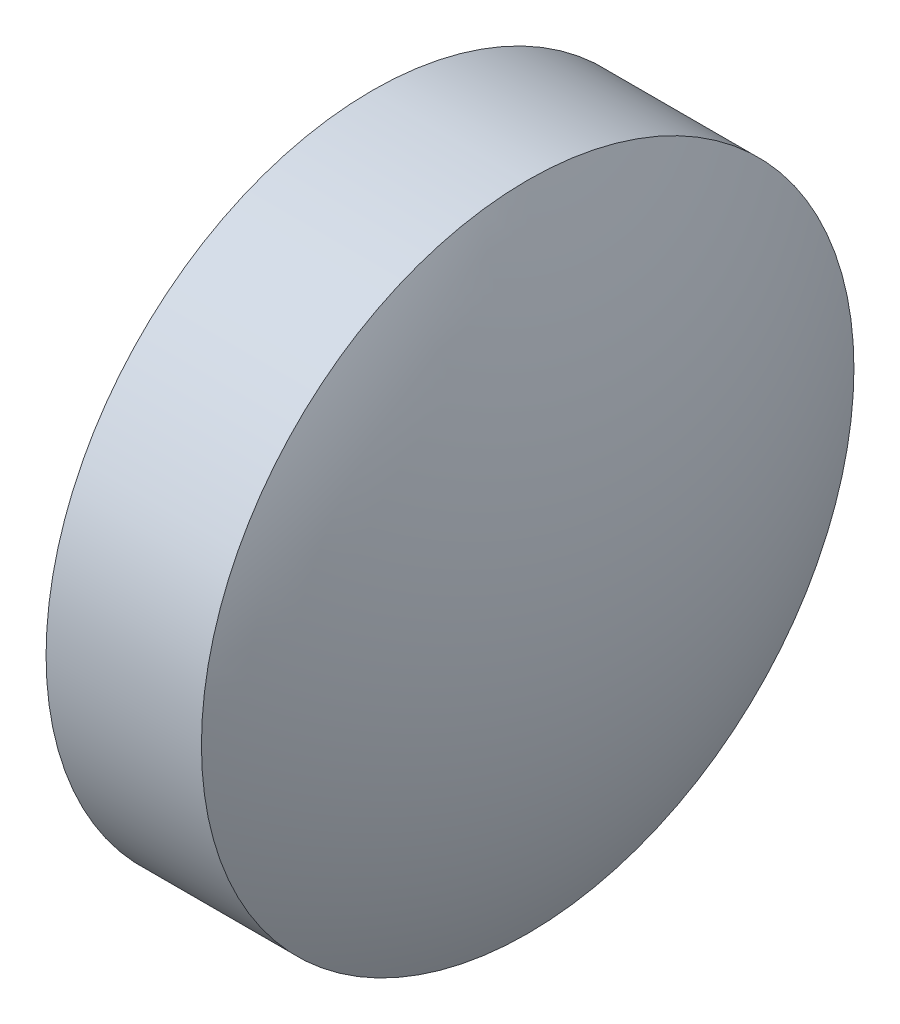
ISO-10303-21;
HEADER;
FILE_DESCRIPTION(('STEP AP214'),'2;1');
FILE_NAME('part.step','',(''),(''),'','','');
FILE_SCHEMA(('AUTOMOTIVE_DESIGN { 1 0 10303 214 1 1 1 1 }'));
ENDSEC;
DATA;
#1=APPLICATION_CONTEXT('core data for automotive mechanical design processes');
#2=APPLICATION_PROTOCOL_DEFINITION('international standard','automotive_design',2000,#1);
#3=PRODUCT_CONTEXT('',#1,'mechanical');
#4=PRODUCT('Part','Part','',(#3));
#5=PRODUCT_RELATED_PRODUCT_CATEGORY('part','',(#4));
#6=PRODUCT_DEFINITION_FORMATION('','',#4);
#7=PRODUCT_DEFINITION_CONTEXT('part definition',#1,'design');
#8=PRODUCT_DEFINITION('design','',#6,#7);
#9=PRODUCT_DEFINITION_SHAPE('','',#8);
#10=(LENGTH_UNIT() NAMED_UNIT(*) SI_UNIT(.MILLI.,.METRE.));
#11=(NAMED_UNIT(*) PLANE_ANGLE_UNIT() SI_UNIT($,.RADIAN.));
#12=(NAMED_UNIT(*) SI_UNIT($,.STERADIAN.) SOLID_ANGLE_UNIT());
#13=UNCERTAINTY_MEASURE_WITH_UNIT(LENGTH_MEASURE(1.E-05),#10,'distance_accuracy_value','');
#14=(GEOMETRIC_REPRESENTATION_CONTEXT(3) GLOBAL_UNCERTAINTY_ASSIGNED_CONTEXT((#13)) GLOBAL_UNIT_ASSIGNED_CONTEXT((#10,
#11,#12)) REPRESENTATION_CONTEXT('',''));
#15=CARTESIAN_POINT('',(0.,0.,0.));
#16=DIRECTION('',(0.,0.,1.));
#17=DIRECTION('',(1.,0.,0.));
#18=AXIS2_PLACEMENT_3D('',#15,#16,#17);
#19=CARTESIAN_POINT('',(396.540495166032,12.4456585558419,0.));
#20=DIRECTION('',(-1.,0.,0.));
#21=DIRECTION('',(0.,-1.,0.));
#22=AXIS2_PLACEMENT_3D('',#19,#20,#21);
#23=SPHERICAL_SURFACE('',#22,6.90796052631582);
#24=CARTESIAN_POINT('',(402.688455692348,12.4456585558419,0.));
#25=DIRECTION('',(-1.,0.,0.));
#26=DIRECTION('',(0.,0.,1.));
#27=AXIS2_PLACEMENT_3D('',#24,#25,#26);
#28=CIRCLE('',#27,3.15);
#29=CARTESIAN_POINT('',(402.688455692348,12.4456585558419,3.15));
#30=VERTEX_POINT('',#29);
#31=EDGE_CURVE('E10',#30,#30,#28,.T.);
#32=ORIENTED_EDGE('',*,*,#31,.F.);
#33=EDGE_LOOP('',(#32));
#34=FACE_BOUND('',#33,.T.);
#35=ADVANCED_FACE('F35',(#34),#23,.T.);
#36=CARTESIAN_POINT('',(400.327817603599,12.4456585558419,0.));
#37=DIRECTION('',(-1.,0.,0.));
#38=DIRECTION('',(0.,0.,1.));
#39=AXIS2_PLACEMENT_3D('',#36,#37,#38);
#40=CYLINDRICAL_SURFACE('',#39,3.15);
#41=CARTESIAN_POINT('',(401.188455692348,12.4456585558419,0.));
#42=DIRECTION('',(-1.,0.,0.));
#43=DIRECTION('',(0.,0.,1.));
#44=AXIS2_PLACEMENT_3D('',#41,#42,#43);
#45=CIRCLE('',#44,3.15);
#46=CARTESIAN_POINT('',(401.188455692348,12.4456585558419,3.15));
#47=VERTEX_POINT('',#46);
#48=EDGE_CURVE('E41',#47,#47,#45,.T.);
#49=ORIENTED_EDGE('',*,*,#48,.F.);
#50=EDGE_LOOP('',(#49));
#51=FACE_BOUND('',#50,.T.);
#52=ORIENTED_EDGE('',*,*,#31,.T.);
#53=EDGE_LOOP('',(#52));
#54=FACE_BOUND('',#53,.T.);
#55=ADVANCED_FACE('F49',(#51,#54),#40,.T.);
#56=CARTESIAN_POINT('',(401.188455692348,12.4456585558419,0.));
#57=DIRECTION('',(1.,0.,0.));
#58=DIRECTION('',(0.,0.,-1.));
#59=AXIS2_PLACEMENT_3D('',#56,#57,#58);
#60=PLANE('',#59);
#61=ORIENTED_EDGE('',*,*,#48,.T.);
#62=EDGE_LOOP('',(#61));
#63=FACE_BOUND('',#62,.T.);
#64=ADVANCED_FACE('F47',(#63),#60,.F.);
#65=CLOSED_SHELL('',(#35,#55,#64));
#66=MANIFOLD_SOLID_BREP('B2',#65);
#67=ADVANCED_BREP_SHAPE_REPRESENTATION('',(#18,#66),#14);
#68=SHAPE_DEFINITION_REPRESENTATION(#9,#67);
ENDSEC;
END-ISO-10303-21;
